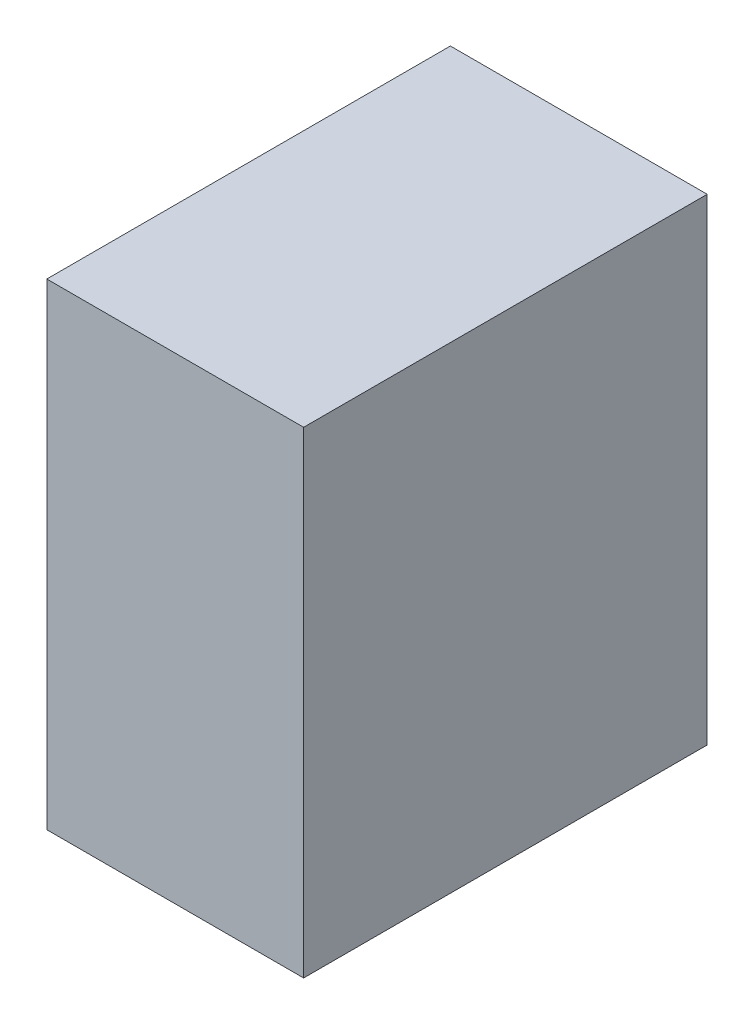
ISO-10303-21;
HEADER;
FILE_DESCRIPTION(('STEP AP214'),'2;1');
FILE_NAME('part.step','',(''),(''),'','','');
FILE_SCHEMA(('AUTOMOTIVE_DESIGN { 1 0 10303 214 1 1 1 1 }'));
ENDSEC;
DATA;
#1=APPLICATION_CONTEXT('core data for automotive mechanical design processes');
#2=APPLICATION_PROTOCOL_DEFINITION('international standard','automotive_design',2000,#1);
#3=PRODUCT_CONTEXT('',#1,'mechanical');
#4=PRODUCT('Part','Part','',(#3));
#5=PRODUCT_RELATED_PRODUCT_CATEGORY('part','',(#4));
#6=PRODUCT_DEFINITION_FORMATION('','',#4);
#7=PRODUCT_DEFINITION_CONTEXT('part definition',#1,'design');
#8=PRODUCT_DEFINITION('design','',#6,#7);
#9=PRODUCT_DEFINITION_SHAPE('','',#8);
#10=(LENGTH_UNIT() NAMED_UNIT(*) SI_UNIT(.MILLI.,.METRE.));
#11=(NAMED_UNIT(*) PLANE_ANGLE_UNIT() SI_UNIT($,.RADIAN.));
#12=(NAMED_UNIT(*) SI_UNIT($,.STERADIAN.) SOLID_ANGLE_UNIT());
#13=UNCERTAINTY_MEASURE_WITH_UNIT(LENGTH_MEASURE(1.E-05),#10,'distance_accuracy_value','');
#14=(GEOMETRIC_REPRESENTATION_CONTEXT(3) GLOBAL_UNCERTAINTY_ASSIGNED_CONTEXT((#13)) GLOBAL_UNIT_ASSIGNED_CONTEXT((#10,
#11,#12)) REPRESENTATION_CONTEXT('',''));
#15=CARTESIAN_POINT('',(0.,0.,0.));
#16=DIRECTION('',(0.,0.,1.));
#17=DIRECTION('',(1.,0.,0.));
#18=AXIS2_PLACEMENT_3D('',#15,#16,#17);
#19=CARTESIAN_POINT('',(0.17500092,-0.32500062,0.));
#20=DIRECTION('',(-1.,0.,0.));
#21=DIRECTION('',(0.,0.,1.));
#22=AXIS2_PLACEMENT_3D('',#19,#20,#21);
#23=PLANE('',#22);
#24=DIRECTION('',(0.,0.,-1.));
#25=VECTOR('',#24,1.);
#26=CARTESIAN_POINT('',(0.17500092,0.32500062,0.));
#27=LINE('',#26,#25);
#28=CARTESIAN_POINT('',(0.17500092,0.32500062,0.));
#29=VERTEX_POINT('',#28);
#30=CARTESIAN_POINT('',(0.17500092,0.32500062,0.5499989));
#31=VERTEX_POINT('',#30);
#32=EDGE_CURVE('E20',#29,#31,#27,.F.);
#33=ORIENTED_EDGE('',*,*,#32,.T.);
#34=DIRECTION('',(0.,1.,0.));
#35=VECTOR('',#34,1.);
#36=CARTESIAN_POINT('',(0.17500092,0.32500062,0.5499989));
#37=LINE('',#36,#35);
#38=CARTESIAN_POINT('',(0.17500092,-0.32500062,0.5499989));
#39=VERTEX_POINT('',#38);
#40=EDGE_CURVE('E55',#31,#39,#37,.F.);
#41=ORIENTED_EDGE('',*,*,#40,.T.);
#42=DIRECTION('',(0.,0.,1.));
#43=VECTOR('',#42,1.);
#44=CARTESIAN_POINT('',(0.17500092,-0.32500062,0.));
#45=LINE('',#44,#43);
#46=CARTESIAN_POINT('',(0.17500092,-0.32500062,0.));
#47=VERTEX_POINT('',#46);
#48=EDGE_CURVE('E76',#39,#47,#45,.F.);
#49=ORIENTED_EDGE('',*,*,#48,.T.);
#50=DIRECTION('',(0.,1.,0.));
#51=VECTOR('',#50,1.);
#52=CARTESIAN_POINT('',(0.17500092,0.32500062,0.));
#53=LINE('',#52,#51);
#54=EDGE_CURVE('E58',#29,#47,#53,.F.);
#55=ORIENTED_EDGE('',*,*,#54,.F.);
#56=EDGE_LOOP('',(#33,#41,#49,#55));
#57=FACE_BOUND('',#56,.T.);
#58=ADVANCED_FACE('F17',(#57),#23,.F.);
#59=CARTESIAN_POINT('',(0.17500092,0.32500062,0.));
#60=DIRECTION('',(0.,-1.,0.));
#61=DIRECTION('',(0.,0.,-1.));
#62=AXIS2_PLACEMENT_3D('',#59,#60,#61);
#63=PLANE('',#62);
#64=DIRECTION('',(0.,0.,-1.));
#65=VECTOR('',#64,1.);
#66=CARTESIAN_POINT('',(-0.17500092,0.32500062,0.));
#67=LINE('',#66,#65);
#68=CARTESIAN_POINT('',(-0.17500092,0.32500062,0.));
#69=VERTEX_POINT('',#68);
#70=CARTESIAN_POINT('',(-0.17500092,0.32500062,0.5499989));
#71=VERTEX_POINT('',#70);
#72=EDGE_CURVE('E73',#69,#71,#67,.F.);
#73=ORIENTED_EDGE('',*,*,#72,.T.);
#74=DIRECTION('',(-1.,0.,0.));
#75=VECTOR('',#74,1.);
#76=CARTESIAN_POINT('',(-0.17500092,0.32500062,0.5499989));
#77=LINE('',#76,#75);
#78=EDGE_CURVE('E63',#71,#31,#77,.F.);
#79=ORIENTED_EDGE('',*,*,#78,.T.);
#80=ORIENTED_EDGE('',*,*,#32,.F.);
#81=DIRECTION('',(-1.,0.,0.));
#82=VECTOR('',#81,1.);
#83=CARTESIAN_POINT('',(-0.17500092,0.32500062,0.));
#84=LINE('',#83,#82);
#85=EDGE_CURVE('E78',#69,#29,#84,.F.);
#86=ORIENTED_EDGE('',*,*,#85,.F.);
#87=EDGE_LOOP('',(#73,#79,#80,#86));
#88=FACE_BOUND('',#87,.T.);
#89=ADVANCED_FACE('F72',(#88),#63,.F.);
#90=CARTESIAN_POINT('',(-0.17500092,0.32500062,0.5499989));
#91=DIRECTION('',(0.,0.,-1.));
#92=DIRECTION('',(-1.,0.,0.));
#93=AXIS2_PLACEMENT_3D('',#90,#91,#92);
#94=PLANE('',#93);
#95=DIRECTION('',(1.,0.,0.));
#96=VECTOR('',#95,1.);
#97=CARTESIAN_POINT('',(-0.17500092,-0.32500062,0.5499989));
#98=LINE('',#97,#96);
#99=CARTESIAN_POINT('',(-0.17500092,-0.32500062,0.5499989));
#100=VERTEX_POINT('',#99);
#101=EDGE_CURVE('E69',#100,#39,#98,.T.);
#102=ORIENTED_EDGE('',*,*,#101,.T.);
#103=ORIENTED_EDGE('',*,*,#40,.F.);
#104=ORIENTED_EDGE('',*,*,#78,.F.);
#105=DIRECTION('',(0.,1.,0.));
#106=VECTOR('',#105,1.);
#107=CARTESIAN_POINT('',(-0.17500092,0.32500062,0.5499989));
#108=LINE('',#107,#106);
#109=EDGE_CURVE('E83',#71,#100,#108,.F.);
#110=ORIENTED_EDGE('',*,*,#109,.T.);
#111=EDGE_LOOP('',(#102,#103,#104,#110));
#112=FACE_BOUND('',#111,.T.);
#113=ADVANCED_FACE('F66',(#112),#94,.F.);
#114=CARTESIAN_POINT('',(-0.17500092,-0.32500062,0.));
#115=DIRECTION('',(0.,1.,0.));
#116=DIRECTION('',(0.,0.,1.));
#117=AXIS2_PLACEMENT_3D('',#114,#115,#116);
#118=PLANE('',#117);
#119=ORIENTED_EDGE('',*,*,#48,.F.);
#120=ORIENTED_EDGE('',*,*,#101,.F.);
#121=DIRECTION('',(0.,0.,-1.));
#122=VECTOR('',#121,1.);
#123=CARTESIAN_POINT('',(-0.17500092,-0.32500062,0.));
#124=LINE('',#123,#122);
#125=CARTESIAN_POINT('',(-0.17500092,-0.32500062,0.));
#126=VERTEX_POINT('',#125);
#127=EDGE_CURVE('E26',#100,#126,#124,.T.);
#128=ORIENTED_EDGE('',*,*,#127,.T.);
#129=DIRECTION('',(-1.,0.,0.));
#130=VECTOR('',#129,1.);
#131=CARTESIAN_POINT('',(-0.17500092,-0.32500062,0.));
#132=LINE('',#131,#130);
#133=EDGE_CURVE('E34',#47,#126,#132,.T.);
#134=ORIENTED_EDGE('',*,*,#133,.F.);
#135=EDGE_LOOP('',(#119,#120,#128,#134));
#136=FACE_BOUND('',#135,.T.);
#137=ADVANCED_FACE('F88',(#136),#118,.F.);
#138=CARTESIAN_POINT('',(-0.17500092,0.32500062,0.));
#139=DIRECTION('',(0.,0.,-1.));
#140=DIRECTION('',(-1.,0.,0.));
#141=AXIS2_PLACEMENT_3D('',#138,#139,#140);
#142=PLANE('',#141);
#143=ORIENTED_EDGE('',*,*,#133,.T.);
#144=DIRECTION('',(0.,1.,0.));
#145=VECTOR('',#144,1.);
#146=CARTESIAN_POINT('',(-0.17500092,0.32500062,0.));
#147=LINE('',#146,#145);
#148=EDGE_CURVE('E11',#126,#69,#147,.T.);
#149=ORIENTED_EDGE('',*,*,#148,.T.);
#150=ORIENTED_EDGE('',*,*,#85,.T.);
#151=ORIENTED_EDGE('',*,*,#54,.T.);
#152=EDGE_LOOP('',(#143,#149,#150,#151));
#153=FACE_BOUND('',#152,.T.);
#154=ADVANCED_FACE('F91',(#153),#142,.T.);
#155=CARTESIAN_POINT('',(-0.17500092,0.32500062,0.));
#156=DIRECTION('',(1.,0.,0.));
#157=DIRECTION('',(0.,0.,-1.));
#158=AXIS2_PLACEMENT_3D('',#155,#156,#157);
#159=PLANE('',#158);
#160=ORIENTED_EDGE('',*,*,#127,.F.);
#161=ORIENTED_EDGE('',*,*,#109,.F.);
#162=ORIENTED_EDGE('',*,*,#72,.F.);
#163=ORIENTED_EDGE('',*,*,#148,.F.);
#164=EDGE_LOOP('',(#160,#161,#162,#163));
#165=FACE_BOUND('',#164,.T.);
#166=ADVANCED_FACE('F90',(#165),#159,.F.);
#167=CLOSED_SHELL('',(#58,#89,#113,#137,#154,#166));
#168=MANIFOLD_SOLID_BREP('B1',#167);
#169=ADVANCED_BREP_SHAPE_REPRESENTATION('',(#18,#168),#14);
#170=SHAPE_DEFINITION_REPRESENTATION(#9,#169);
ENDSEC;
END-ISO-10303-21;
